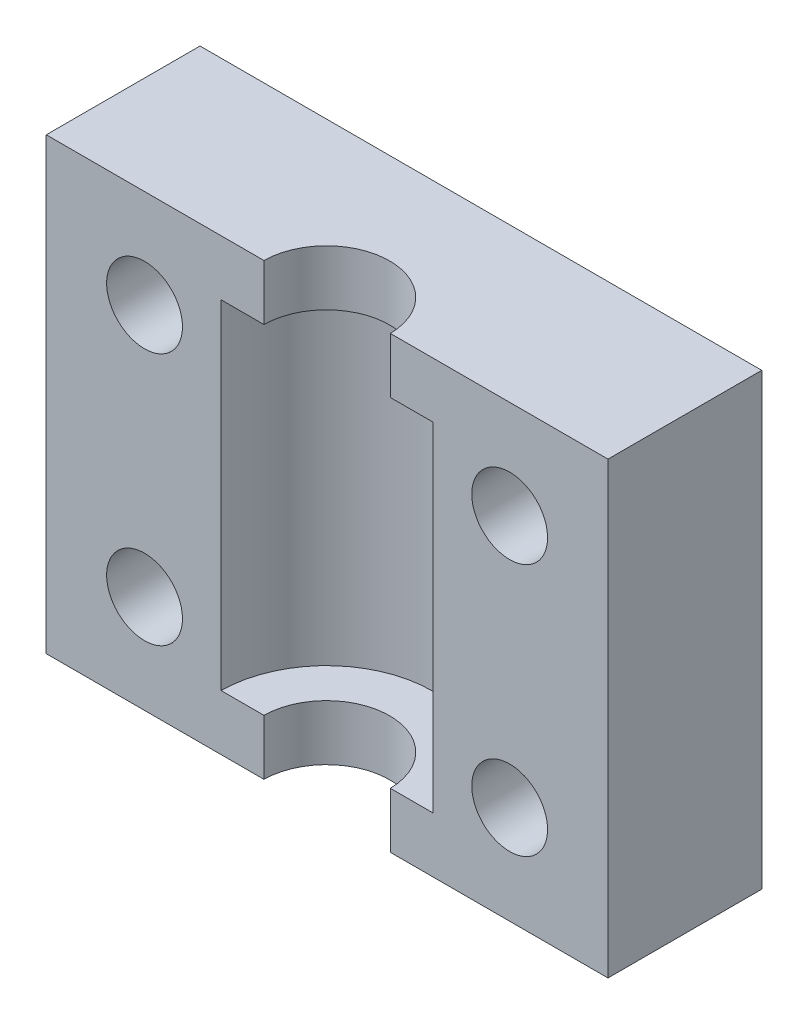
ISO-10303-21;
HEADER;
FILE_DESCRIPTION(('STEP AP214'),'2;1');
FILE_NAME('part.step','',(''),(''),'','','');
FILE_SCHEMA(('AUTOMOTIVE_DESIGN { 1 0 10303 214 1 1 1 1 }'));
ENDSEC;
DATA;
#1=APPLICATION_CONTEXT('core data for automotive mechanical design processes');
#2=APPLICATION_PROTOCOL_DEFINITION('international standard','automotive_design',2000,#1);
#3=PRODUCT_CONTEXT('',#1,'mechanical');
#4=PRODUCT('Part','Part','',(#3));
#5=PRODUCT_RELATED_PRODUCT_CATEGORY('part','',(#4));
#6=PRODUCT_DEFINITION_FORMATION('','',#4);
#7=PRODUCT_DEFINITION_CONTEXT('part definition',#1,'design');
#8=PRODUCT_DEFINITION('design','',#6,#7);
#9=PRODUCT_DEFINITION_SHAPE('','',#8);
#10=(LENGTH_UNIT() NAMED_UNIT(*) SI_UNIT(.MILLI.,.METRE.));
#11=(NAMED_UNIT(*) PLANE_ANGLE_UNIT() SI_UNIT($,.RADIAN.));
#12=(NAMED_UNIT(*) SI_UNIT($,.STERADIAN.) SOLID_ANGLE_UNIT());
#13=UNCERTAINTY_MEASURE_WITH_UNIT(LENGTH_MEASURE(1.E-05),#10,'distance_accuracy_value','');
#14=(GEOMETRIC_REPRESENTATION_CONTEXT(3) GLOBAL_UNCERTAINTY_ASSIGNED_CONTEXT((#13)) GLOBAL_UNIT_ASSIGNED_CONTEXT((#10,
#11,#12)) REPRESENTATION_CONTEXT('',''));
#15=CARTESIAN_POINT('',(0.,0.,0.));
#16=DIRECTION('',(0.,0.,1.));
#17=DIRECTION('',(1.,0.,0.));
#18=AXIS2_PLACEMENT_3D('',#15,#16,#17);
#19=CARTESIAN_POINT('',(-339.725,6547.28699999999,2827.35040000001));
#20=DIRECTION('',(0.,-1.,0.));
#21=DIRECTION('',(0.,0.,-1.));
#22=AXIS2_PLACEMENT_3D('',#19,#20,#21);
#23=CYLINDRICAL_SURFACE('',#22,4.49999999999981);
#24=CARTESIAN_POINT('',(-339.725,6545.31200000001,2827.35040000001));
#25=DIRECTION('',(0.,-1.,0.));
#26=DIRECTION('',(0.,0.,-1.));
#27=AXIS2_PLACEMENT_3D('',#24,#25,#26);
#28=CIRCLE('',#27,4.49999999999981);
#29=CARTESIAN_POINT('',(-344.224722213649,6545.31200000001,2827.30040000001));
#30=VERTEX_POINT('',#29);
#31=CARTESIAN_POINT('',(-335.225277786351,6545.31200000001,2827.30040000001));
#32=VERTEX_POINT('',#31);
#33=EDGE_CURVE('E103',#30,#32,#28,.T.);
#34=ORIENTED_EDGE('',*,*,#33,.T.);
#35=DIRECTION('',(0.,1.,0.));
#36=VECTOR('',#35,1.);
#37=CARTESIAN_POINT('',(-335.225277786351,6533.26200000001,2827.30040000001));
#38=LINE('',#37,#36);
#39=CARTESIAN_POINT('',(-335.225277786351,6549.26199999999,2827.30040000001));
#40=VERTEX_POINT('',#39);
#41=EDGE_CURVE('E245',#32,#40,#38,.T.);
#42=ORIENTED_EDGE('',*,*,#41,.T.);
#43=CARTESIAN_POINT('',(-339.725,6549.26199999999,2827.35040000001));
#44=DIRECTION('',(0.,-1.,0.));
#45=DIRECTION('',(0.,0.,-1.));
#46=AXIS2_PLACEMENT_3D('',#43,#44,#45);
#47=CIRCLE('',#46,4.49999999999981);
#48=CARTESIAN_POINT('',(-344.224722213649,6549.26199999999,2827.30040000001));
#49=VERTEX_POINT('',#48);
#50=EDGE_CURVE('E153',#49,#40,#47,.T.);
#51=ORIENTED_EDGE('',*,*,#50,.F.);
#52=DIRECTION('',(0.,1.,0.));
#53=VECTOR('',#52,1.);
#54=CARTESIAN_POINT('',(-344.224722213649,6533.26200000001,2827.30040000001));
#55=LINE('',#54,#53);
#56=EDGE_CURVE('E147',#49,#30,#55,.F.);
#57=ORIENTED_EDGE('',*,*,#56,.T.);
#58=EDGE_LOOP('',(#34,#42,#51,#57));
#59=FACE_BOUND('',#58,.T.);
#60=ADVANCED_FACE('F100',(#59),#23,.F.);
#61=CARTESIAN_POINT('',(-332.175,6545.31200000001,2827.35040000001));
#62=DIRECTION('',(0.,1.,0.));
#63=DIRECTION('',(0.,0.,1.));
#64=AXIS2_PLACEMENT_3D('',#61,#62,#63);
#65=PLANE('',#64);
#66=CARTESIAN_POINT('',(-339.725,6545.31200000001,2827.35040000001));
#67=DIRECTION('',(0.,-1.,0.));
#68=DIRECTION('',(0.,0.,-1.));
#69=AXIS2_PLACEMENT_3D('',#66,#67,#68);
#70=CIRCLE('',#69,7.54999999999982);
#71=CARTESIAN_POINT('',(-347.274834435271,6545.31200000001,2827.30040000001));
#72=VERTEX_POINT('',#71);
#73=CARTESIAN_POINT('',(-332.175165564729,6545.31200000001,2827.30040000001));
#74=VERTEX_POINT('',#73);
#75=EDGE_CURVE('E291',#72,#74,#70,.T.);
#76=ORIENTED_EDGE('',*,*,#75,.T.);
#77=DIRECTION('',(-1.,0.,0.));
#78=VECTOR('',#77,1.);
#79=CARTESIAN_POINT('',(-339.725,6545.31200000001,2827.30040000001));
#80=LINE('',#79,#78);
#81=EDGE_CURVE('E249',#74,#32,#80,.T.);
#82=ORIENTED_EDGE('',*,*,#81,.T.);
#83=ORIENTED_EDGE('',*,*,#33,.F.);
#84=DIRECTION('',(-1.,0.,0.));
#85=VECTOR('',#84,1.);
#86=CARTESIAN_POINT('',(-339.725,6545.31200000001,2827.30040000001));
#87=LINE('',#86,#85);
#88=EDGE_CURVE('E233',#30,#72,#87,.T.);
#89=ORIENTED_EDGE('',*,*,#88,.T.);
#90=EDGE_LOOP('',(#76,#82,#83,#89));
#91=FACE_BOUND('',#90,.T.);
#92=ADVANCED_FACE('F297',(#91),#65,.F.);
#93=CARTESIAN_POINT('',(-339.725,6533.26200000001,2827.35040000001));
#94=DIRECTION('',(0.,-1.,0.));
#95=DIRECTION('',(0.,0.,-1.));
#96=AXIS2_PLACEMENT_3D('',#93,#94,#95);
#97=CYLINDRICAL_SURFACE('',#96,7.54999999999982);
#98=CARTESIAN_POINT('',(-339.725,6521.212,2827.35040000001));
#99=DIRECTION('',(0.,-1.,0.));
#100=DIRECTION('',(0.,0.,-1.));
#101=AXIS2_PLACEMENT_3D('',#98,#99,#100);
#102=CIRCLE('',#101,7.54999999999982);
#103=CARTESIAN_POINT('',(-347.274834435271,6521.212,2827.30040000001));
#104=VERTEX_POINT('',#103);
#105=CARTESIAN_POINT('',(-332.175165564729,6521.212,2827.30040000001));
#106=VERTEX_POINT('',#105);
#107=EDGE_CURVE('E290',#104,#106,#102,.T.);
#108=ORIENTED_EDGE('',*,*,#107,.T.);
#109=DIRECTION('',(0.,1.,0.));
#110=VECTOR('',#109,1.);
#111=CARTESIAN_POINT('',(-332.175165564728,6533.26200000001,2827.30040000001));
#112=LINE('',#111,#110);
#113=EDGE_CURVE('E252',#106,#74,#112,.T.);
#114=ORIENTED_EDGE('',*,*,#113,.T.);
#115=ORIENTED_EDGE('',*,*,#75,.F.);
#116=DIRECTION('',(0.,1.,0.));
#117=VECTOR('',#116,1.);
#118=CARTESIAN_POINT('',(-347.274834435272,6533.26200000001,2827.30040000001));
#119=LINE('',#118,#117);
#120=EDGE_CURVE('E231',#72,#104,#119,.F.);
#121=ORIENTED_EDGE('',*,*,#120,.T.);
#122=EDGE_LOOP('',(#108,#114,#115,#121));
#123=FACE_BOUND('',#122,.T.);
#124=ADVANCED_FACE('F315',(#123),#97,.F.);
#125=CARTESIAN_POINT('',(-335.225,6521.212,2827.35040000001));
#126=DIRECTION('',(0.,-1.,0.));
#127=DIRECTION('',(0.,0.,-1.));
#128=AXIS2_PLACEMENT_3D('',#125,#126,#127);
#129=PLANE('',#128);
#130=CARTESIAN_POINT('',(-339.725,6521.212,2827.35040000001));
#131=DIRECTION('',(0.,-1.,0.));
#132=DIRECTION('',(0.,0.,-1.));
#133=AXIS2_PLACEMENT_3D('',#130,#131,#132);
#134=CIRCLE('',#133,4.49999999999981);
#135=CARTESIAN_POINT('',(-344.224722213649,6521.212,2827.30040000001));
#136=VERTEX_POINT('',#135);
#137=CARTESIAN_POINT('',(-335.225277786351,6521.212,2827.30040000001));
#138=VERTEX_POINT('',#137);
#139=EDGE_CURVE('E288',#136,#138,#134,.T.);
#140=ORIENTED_EDGE('',*,*,#139,.T.);
#141=DIRECTION('',(-1.,0.,0.));
#142=VECTOR('',#141,1.);
#143=CARTESIAN_POINT('',(-339.725,6521.212,2827.30040000001));
#144=LINE('',#143,#142);
#145=EDGE_CURVE('E255',#138,#106,#144,.F.);
#146=ORIENTED_EDGE('',*,*,#145,.T.);
#147=ORIENTED_EDGE('',*,*,#107,.F.);
#148=DIRECTION('',(-1.,0.,0.));
#149=VECTOR('',#148,1.);
#150=CARTESIAN_POINT('',(-339.725,6521.212,2827.30040000001));
#151=LINE('',#150,#149);
#152=EDGE_CURVE('E229',#104,#136,#151,.F.);
#153=ORIENTED_EDGE('',*,*,#152,.T.);
#154=EDGE_LOOP('',(#140,#146,#147,#153));
#155=FACE_BOUND('',#154,.T.);
#156=ADVANCED_FACE('F319',(#155),#129,.F.);
#157=CARTESIAN_POINT('',(-339.725,6519.237,2827.35040000001));
#158=DIRECTION('',(0.,-1.,0.));
#159=DIRECTION('',(0.,0.,-1.));
#160=AXIS2_PLACEMENT_3D('',#157,#158,#159);
#161=CYLINDRICAL_SURFACE('',#160,4.49999999999981);
#162=CARTESIAN_POINT('',(-339.725,6517.26199999999,2827.35040000001));
#163=DIRECTION('',(0.,-1.,0.));
#164=DIRECTION('',(0.,0.,-1.));
#165=AXIS2_PLACEMENT_3D('',#162,#163,#164);
#166=CIRCLE('',#165,4.49999999999981);
#167=CARTESIAN_POINT('',(-335.225277786351,6517.26199999999,2827.30040000001));
#168=VERTEX_POINT('',#167);
#169=CARTESIAN_POINT('',(-344.224722213649,6517.26199999999,2827.30040000001));
#170=VERTEX_POINT('',#169);
#171=EDGE_CURVE('E286',#168,#170,#166,.F.);
#172=ORIENTED_EDGE('',*,*,#171,.F.);
#173=DIRECTION('',(0.,1.,0.));
#174=VECTOR('',#173,1.);
#175=CARTESIAN_POINT('',(-335.225277786351,6533.26200000001,2827.30040000001));
#176=LINE('',#175,#174);
#177=EDGE_CURVE('E258',#168,#138,#176,.T.);
#178=ORIENTED_EDGE('',*,*,#177,.T.);
#179=ORIENTED_EDGE('',*,*,#139,.F.);
#180=DIRECTION('',(0.,1.,0.));
#181=VECTOR('',#180,1.);
#182=CARTESIAN_POINT('',(-344.224722213649,6533.26200000001,2827.30040000001));
#183=LINE('',#182,#181);
#184=EDGE_CURVE('E118',#136,#170,#183,.F.);
#185=ORIENTED_EDGE('',*,*,#184,.T.);
#186=EDGE_LOOP('',(#172,#178,#179,#185));
#187=FACE_BOUND('',#186,.T.);
#188=ADVANCED_FACE('F320',(#187),#161,.F.);
#189=CARTESIAN_POINT('',(-319.725000000001,6517.26199999999,2827.35040000001));
#190=DIRECTION('',(0.,-1.,0.));
#191=DIRECTION('',(0.,0.,-1.));
#192=AXIS2_PLACEMENT_3D('',#189,#190,#191);
#193=PLANE('',#192);
#194=DIRECTION('',(-1.,0.,0.));
#195=VECTOR('',#194,1.);
#196=CARTESIAN_POINT('',(-339.725,6517.26199999999,2827.30040000001));
#197=LINE('',#196,#195);
#198=CARTESIAN_POINT('',(-359.724999999999,6517.262,2827.30040000001));
#199=VERTEX_POINT('',#198);
#200=EDGE_CURVE('E221',#170,#199,#197,.T.);
#201=ORIENTED_EDGE('',*,*,#200,.T.);
#202=DIRECTION('',(0.,0.,-1.));
#203=VECTOR('',#202,1.);
#204=CARTESIAN_POINT('',(-359.724999999999,6517.262,2834.37146781187));
#205=LINE('',#204,#203);
#206=CARTESIAN_POINT('',(-359.724999999999,6517.262,2816.3504));
#207=VERTEX_POINT('',#206);
#208=EDGE_CURVE('E212',#199,#207,#205,.T.);
#209=ORIENTED_EDGE('',*,*,#208,.T.);
#210=DIRECTION('',(-1.,-1.48029736616735E-13,0.));
#211=VECTOR('',#210,1.);
#212=CARTESIAN_POINT('',(-324.725000000007,6517.262,2816.3504));
#213=LINE('',#212,#211);
#214=CARTESIAN_POINT('',(-319.725000000004,6517.262,2816.3504));
#215=VERTEX_POINT('',#214);
#216=EDGE_CURVE('E193',#215,#207,#213,.T.);
#217=ORIENTED_EDGE('',*,*,#216,.F.);
#218=DIRECTION('',(0.,0.,-1.));
#219=VECTOR('',#218,1.);
#220=CARTESIAN_POINT('',(-319.725000000004,6517.262,2834.37146781187));
#221=LINE('',#220,#219);
#222=CARTESIAN_POINT('',(-319.725000000004,6517.262,2827.30040000001));
#223=VERTEX_POINT('',#222);
#224=EDGE_CURVE('E190',#223,#215,#221,.T.);
#225=ORIENTED_EDGE('',*,*,#224,.F.);
#226=DIRECTION('',(-1.,0.,0.));
#227=VECTOR('',#226,1.);
#228=CARTESIAN_POINT('',(-339.725,6517.26199999999,2827.30040000001));
#229=LINE('',#228,#227);
#230=EDGE_CURVE('E261',#223,#168,#229,.T.);
#231=ORIENTED_EDGE('',*,*,#230,.T.);
#232=ORIENTED_EDGE('',*,*,#171,.T.);
#233=EDGE_LOOP('',(#201,#209,#217,#225,#231,#232));
#234=FACE_BOUND('',#233,.T.);
#235=ADVANCED_FACE('F304',(#234),#193,.T.);
#236=CARTESIAN_POINT('',(-359.724999999999,6517.26199999999,2827.35040000001));
#237=DIRECTION('',(-1.,0.,0.));
#238=DIRECTION('',(0.,0.,1.));
#239=AXIS2_PLACEMENT_3D('',#236,#237,#238);
#240=PLANE('',#239);
#241=DIRECTION('',(0.,1.,0.));
#242=VECTOR('',#241,1.);
#243=CARTESIAN_POINT('',(-359.724999999999,6533.26200000001,2827.30040000001));
#244=LINE('',#243,#242);
#245=CARTESIAN_POINT('',(-359.724999999997,6549.26199999999,2827.30040000001));
#246=VERTEX_POINT('',#245);
#247=EDGE_CURVE('E217',#199,#246,#244,.T.);
#248=ORIENTED_EDGE('',*,*,#247,.T.);
#249=DIRECTION('',(0.,0.,-1.));
#250=VECTOR('',#249,1.);
#251=CARTESIAN_POINT('',(-359.724999999997,6549.26199999999,2834.37146781187));
#252=LINE('',#251,#250);
#253=CARTESIAN_POINT('',(-359.724999999997,6549.26199999999,2816.3504));
#254=VERTEX_POINT('',#253);
#255=EDGE_CURVE('E208',#246,#254,#252,.T.);
#256=ORIENTED_EDGE('',*,*,#255,.T.);
#257=DIRECTION('',(1.00929365874964E-13,1.,0.));
#258=VECTOR('',#257,1.);
#259=CARTESIAN_POINT('',(-359.724999999999,6522.262,2816.3504));
#260=LINE('',#259,#258);
#261=EDGE_CURVE('E198',#207,#254,#260,.T.);
#262=ORIENTED_EDGE('',*,*,#261,.F.);
#263=ORIENTED_EDGE('',*,*,#208,.F.);
#264=EDGE_LOOP('',(#248,#256,#262,#263));
#265=FACE_BOUND('',#264,.T.);
#266=ADVANCED_FACE('F308',(#265),#240,.T.);
#267=CARTESIAN_POINT('',(-359.724999999999,6549.26199999999,2827.35040000001));
#268=DIRECTION('',(0.,1.,0.));
#269=DIRECTION('',(0.,0.,1.));
#270=AXIS2_PLACEMENT_3D('',#267,#268,#269);
#271=PLANE('',#270);
#272=DIRECTION('',(-1.,0.,0.));
#273=VECTOR('',#272,1.);
#274=CARTESIAN_POINT('',(-339.725,6549.26199999999,2827.30040000001));
#275=LINE('',#274,#273);
#276=CARTESIAN_POINT('',(-319.725000000001,6549.262,2827.30040000001));
#277=VERTEX_POINT('',#276);
#278=EDGE_CURVE('E206',#40,#277,#275,.F.);
#279=ORIENTED_EDGE('',*,*,#278,.T.);
#280=DIRECTION('',(0.,0.,-1.));
#281=VECTOR('',#280,1.);
#282=CARTESIAN_POINT('',(-319.725000000001,6549.262,2834.37146781187));
#283=LINE('',#282,#281);
#284=CARTESIAN_POINT('',(-319.725000000001,6549.262,2816.3504));
#285=VERTEX_POINT('',#284);
#286=EDGE_CURVE('E188',#277,#285,#283,.T.);
#287=ORIENTED_EDGE('',*,*,#286,.T.);
#288=DIRECTION('',(1.,1.48029736616643E-13,0.));
#289=VECTOR('',#288,1.);
#290=CARTESIAN_POINT('',(-354.725000000003,6549.26199999999,2816.3504));
#291=LINE('',#290,#289);
#292=EDGE_CURVE('E194',#254,#285,#291,.T.);
#293=ORIENTED_EDGE('',*,*,#292,.F.);
#294=ORIENTED_EDGE('',*,*,#255,.F.);
#295=DIRECTION('',(-1.,0.,0.));
#296=VECTOR('',#295,1.);
#297=CARTESIAN_POINT('',(-339.725,6549.26199999999,2827.30040000001));
#298=LINE('',#297,#296);
#299=EDGE_CURVE('E236',#246,#49,#298,.F.);
#300=ORIENTED_EDGE('',*,*,#299,.T.);
#301=ORIENTED_EDGE('',*,*,#50,.T.);
#302=EDGE_LOOP('',(#279,#287,#293,#294,#300,#301));
#303=FACE_BOUND('',#302,.T.);
#304=ADVANCED_FACE('F204',(#303),#271,.T.);
#305=CARTESIAN_POINT('',(-319.725000000001,6549.26199999999,2827.35040000001));
#306=DIRECTION('',(1.,0.,0.));
#307=DIRECTION('',(0.,0.,-1.));
#308=AXIS2_PLACEMENT_3D('',#305,#306,#307);
#309=PLANE('',#308);
#310=DIRECTION('',(0.,1.,0.));
#311=VECTOR('',#310,1.);
#312=CARTESIAN_POINT('',(-319.725000000001,6533.26200000001,2827.30040000001));
#313=LINE('',#312,#311);
#314=EDGE_CURVE('E238',#277,#223,#313,.F.);
#315=ORIENTED_EDGE('',*,*,#314,.T.);
#316=ORIENTED_EDGE('',*,*,#224,.T.);
#317=DIRECTION('',(-1.16068770756209E-13,-1.,0.));
#318=VECTOR('',#317,1.);
#319=CARTESIAN_POINT('',(-319.725000000001,6544.26200000001,2816.3504));
#320=LINE('',#319,#318);
#321=EDGE_CURVE('E183',#285,#215,#320,.T.);
#322=ORIENTED_EDGE('',*,*,#321,.F.);
#323=ORIENTED_EDGE('',*,*,#286,.F.);
#324=EDGE_LOOP('',(#315,#316,#322,#323));
#325=FACE_BOUND('',#324,.T.);
#326=ADVANCED_FACE('F186',(#325),#309,.T.);
#327=CARTESIAN_POINT('',(-339.725,6533.26200000001,2827.30040000001));
#328=DIRECTION('',(0.,0.,-1.));
#329=DIRECTION('',(-1.,0.,0.));
#330=AXIS2_PLACEMENT_3D('',#327,#328,#329);
#331=PLANE('',#330);
#332=ORIENTED_EDGE('',*,*,#314,.F.);
#333=ORIENTED_EDGE('',*,*,#278,.F.);
#334=ORIENTED_EDGE('',*,*,#41,.F.);
#335=ORIENTED_EDGE('',*,*,#81,.F.);
#336=ORIENTED_EDGE('',*,*,#113,.F.);
#337=ORIENTED_EDGE('',*,*,#145,.F.);
#338=ORIENTED_EDGE('',*,*,#177,.F.);
#339=ORIENTED_EDGE('',*,*,#230,.F.);
#340=EDGE_LOOP('',(#332,#333,#334,#335,#336,#337,#338,#339));
#341=FACE_BOUND('',#340,.T.);
#342=CARTESIAN_POINT('',(-326.725000000001,6542.262,2827.30040000001));
#343=DIRECTION('',(0.,0.,-1.));
#344=DIRECTION('',(-1.,0.,0.));
#345=AXIS2_PLACEMENT_3D('',#342,#343,#344);
#346=CIRCLE('',#345,2.70000000000002);
#347=CARTESIAN_POINT('',(-329.425000000001,6542.262,2827.30040000001));
#348=VERTEX_POINT('',#347);
#349=EDGE_CURVE('E280',#348,#348,#346,.T.);
#350=ORIENTED_EDGE('',*,*,#349,.T.);
#351=EDGE_LOOP('',(#350));
#352=FACE_BOUND('',#351,.T.);
#353=CARTESIAN_POINT('',(-326.725000000001,6524.26200000002,2827.30040000001));
#354=DIRECTION('',(0.,0.,-1.));
#355=DIRECTION('',(-1.,0.,0.));
#356=AXIS2_PLACEMENT_3D('',#353,#354,#355);
#357=CIRCLE('',#356,2.70000000000002);
#358=CARTESIAN_POINT('',(-329.425000000001,6524.26200000002,2827.30040000001));
#359=VERTEX_POINT('',#358);
#360=EDGE_CURVE('E277',#359,#359,#357,.T.);
#361=ORIENTED_EDGE('',*,*,#360,.T.);
#362=EDGE_LOOP('',(#361));
#363=FACE_BOUND('',#362,.T.);
#364=ADVANCED_FACE('F300',(#341,#352,#363),#331,.F.);
#365=CARTESIAN_POINT('',(-339.725,6533.26200000001,2827.30040000001));
#366=DIRECTION('',(0.,0.,-1.));
#367=DIRECTION('',(-1.,0.,0.));
#368=AXIS2_PLACEMENT_3D('',#365,#366,#367);
#369=PLANE('',#368);
#370=ORIENTED_EDGE('',*,*,#247,.F.);
#371=ORIENTED_EDGE('',*,*,#200,.F.);
#372=ORIENTED_EDGE('',*,*,#184,.F.);
#373=ORIENTED_EDGE('',*,*,#152,.F.);
#374=ORIENTED_EDGE('',*,*,#120,.F.);
#375=ORIENTED_EDGE('',*,*,#88,.F.);
#376=ORIENTED_EDGE('',*,*,#56,.F.);
#377=ORIENTED_EDGE('',*,*,#299,.F.);
#378=EDGE_LOOP('',(#370,#371,#372,#373,#374,#375,#376,#377));
#379=FACE_BOUND('',#378,.T.);
#380=CARTESIAN_POINT('',(-352.724999999999,6524.26200000002,2827.30040000001));
#381=DIRECTION('',(0.,0.,1.));
#382=DIRECTION('',(1.,0.,0.));
#383=AXIS2_PLACEMENT_3D('',#380,#381,#382);
#384=CIRCLE('',#383,2.70000000000002);
#385=CARTESIAN_POINT('',(-350.024999999999,6524.26200000002,2827.30040000001));
#386=VERTEX_POINT('',#385);
#387=EDGE_CURVE('E220',#386,#386,#384,.F.);
#388=ORIENTED_EDGE('',*,*,#387,.T.);
#389=EDGE_LOOP('',(#388));
#390=FACE_BOUND('',#389,.T.);
#391=CARTESIAN_POINT('',(-352.724999999999,6542.262,2827.30040000001));
#392=DIRECTION('',(0.,0.,1.));
#393=DIRECTION('',(1.,0.,0.));
#394=AXIS2_PLACEMENT_3D('',#391,#392,#393);
#395=CIRCLE('',#394,2.70000000000002);
#396=CARTESIAN_POINT('',(-350.024999999999,6542.262,2827.30040000001));
#397=VERTEX_POINT('',#396);
#398=EDGE_CURVE('E274',#397,#397,#395,.F.);
#399=ORIENTED_EDGE('',*,*,#398,.T.);
#400=EDGE_LOOP('',(#399));
#401=FACE_BOUND('',#400,.T.);
#402=ADVANCED_FACE('F310',(#379,#390,#401),#369,.F.);
#403=CARTESIAN_POINT('',(-352.724999999999,6524.26200000002,2827.35040000001));
#404=DIRECTION('',(0.,0.,1.));
#405=DIRECTION('',(1.,0.,0.));
#406=AXIS2_PLACEMENT_3D('',#403,#404,#405);
#407=CYLINDRICAL_SURFACE('',#406,2.70000000000002);
#408=ORIENTED_EDGE('',*,*,#387,.F.);
#409=EDGE_LOOP('',(#408));
#410=FACE_BOUND('',#409,.T.);
#411=CARTESIAN_POINT('',(-352.724999999999,6524.26200000002,2816.3504));
#412=DIRECTION('',(0.,0.,1.));
#413=DIRECTION('',(1.,0.,0.));
#414=AXIS2_PLACEMENT_3D('',#411,#412,#413);
#415=CIRCLE('',#414,2.70000000000002);
#416=CARTESIAN_POINT('',(-350.024999999999,6524.26200000002,2816.3504));
#417=VERTEX_POINT('',#416);
#418=EDGE_CURVE('E271',#417,#417,#415,.T.);
#419=ORIENTED_EDGE('',*,*,#418,.F.);
#420=EDGE_LOOP('',(#419));
#421=FACE_BOUND('',#420,.T.);
#422=ADVANCED_FACE('F347',(#410,#421),#407,.F.);
#423=CARTESIAN_POINT('',(-326.725000000001,6542.262,2827.35040000001));
#424=DIRECTION('',(0.,0.,-1.));
#425=DIRECTION('',(-1.,0.,0.));
#426=AXIS2_PLACEMENT_3D('',#423,#424,#425);
#427=CYLINDRICAL_SURFACE('',#426,2.70000000000002);
#428=ORIENTED_EDGE('',*,*,#349,.F.);
#429=EDGE_LOOP('',(#428));
#430=FACE_BOUND('',#429,.T.);
#431=CARTESIAN_POINT('',(-326.725000000001,6542.262,2816.3504));
#432=DIRECTION('',(0.,0.,-1.));
#433=DIRECTION('',(-1.,0.,0.));
#434=AXIS2_PLACEMENT_3D('',#431,#432,#433);
#435=CIRCLE('',#434,2.70000000000002);
#436=CARTESIAN_POINT('',(-329.425000000001,6542.262,2816.3504));
#437=VERTEX_POINT('',#436);
#438=EDGE_CURVE('E268',#437,#437,#435,.F.);
#439=ORIENTED_EDGE('',*,*,#438,.F.);
#440=EDGE_LOOP('',(#439));
#441=FACE_BOUND('',#440,.T.);
#442=ADVANCED_FACE('F343',(#430,#441),#427,.F.);
#443=CARTESIAN_POINT('',(-326.725000000001,6524.26200000002,2827.35040000001));
#444=DIRECTION('',(0.,0.,-1.));
#445=DIRECTION('',(-1.,0.,0.));
#446=AXIS2_PLACEMENT_3D('',#443,#444,#445);
#447=CYLINDRICAL_SURFACE('',#446,2.70000000000002);
#448=ORIENTED_EDGE('',*,*,#360,.F.);
#449=EDGE_LOOP('',(#448));
#450=FACE_BOUND('',#449,.T.);
#451=CARTESIAN_POINT('',(-326.725000000001,6524.26200000002,2816.3504));
#452=DIRECTION('',(0.,0.,-1.));
#453=DIRECTION('',(-1.,0.,0.));
#454=AXIS2_PLACEMENT_3D('',#451,#452,#453);
#455=CIRCLE('',#454,2.70000000000002);
#456=CARTESIAN_POINT('',(-329.425000000001,6524.26200000002,2816.3504));
#457=VERTEX_POINT('',#456);
#458=EDGE_CURVE('E109',#457,#457,#455,.F.);
#459=ORIENTED_EDGE('',*,*,#458,.F.);
#460=EDGE_LOOP('',(#459));
#461=FACE_BOUND('',#460,.T.);
#462=ADVANCED_FACE('F336',(#450,#461),#447,.F.);
#463=CARTESIAN_POINT('',(-352.724999999999,6542.262,2827.35040000001));
#464=DIRECTION('',(0.,0.,1.));
#465=DIRECTION('',(1.,0.,0.));
#466=AXIS2_PLACEMENT_3D('',#463,#464,#465);
#467=CYLINDRICAL_SURFACE('',#466,2.70000000000002);
#468=ORIENTED_EDGE('',*,*,#398,.F.);
#469=EDGE_LOOP('',(#468));
#470=FACE_BOUND('',#469,.T.);
#471=CARTESIAN_POINT('',(-352.724999999999,6542.262,2816.3504));
#472=DIRECTION('',(0.,0.,1.));
#473=DIRECTION('',(1.,0.,0.));
#474=AXIS2_PLACEMENT_3D('',#471,#472,#473);
#475=CIRCLE('',#474,2.70000000000002);
#476=CARTESIAN_POINT('',(-350.024999999999,6542.262,2816.3504));
#477=VERTEX_POINT('',#476);
#478=EDGE_CURVE('E14',#477,#477,#475,.T.);
#479=ORIENTED_EDGE('',*,*,#478,.F.);
#480=EDGE_LOOP('',(#479));
#481=FACE_BOUND('',#480,.T.);
#482=ADVANCED_FACE('F330',(#470,#481),#467,.F.);
#483=CARTESIAN_POINT('',(-339.725,6533.26200000001,2816.3504));
#484=DIRECTION('',(0.,0.,-1.));
#485=DIRECTION('',(-1.,0.,0.));
#486=AXIS2_PLACEMENT_3D('',#483,#484,#485);
#487=PLANE('',#486);
#488=ORIENTED_EDGE('',*,*,#478,.T.);
#489=EDGE_LOOP('',(#488));
#490=FACE_BOUND('',#489,.T.);
#491=ORIENTED_EDGE('',*,*,#458,.T.);
#492=EDGE_LOOP('',(#491));
#493=FACE_BOUND('',#492,.T.);
#494=ORIENTED_EDGE('',*,*,#438,.T.);
#495=EDGE_LOOP('',(#494));
#496=FACE_BOUND('',#495,.T.);
#497=ORIENTED_EDGE('',*,*,#418,.T.);
#498=EDGE_LOOP('',(#497));
#499=FACE_BOUND('',#498,.T.);
#500=ORIENTED_EDGE('',*,*,#261,.T.);
#501=ORIENTED_EDGE('',*,*,#292,.T.);
#502=ORIENTED_EDGE('',*,*,#321,.T.);
#503=ORIENTED_EDGE('',*,*,#216,.T.);
#504=EDGE_LOOP('',(#500,#501,#502,#503));
#505=FACE_BOUND('',#504,.T.);
#506=ADVANCED_FACE('F197',(#490,#493,#496,#499,#505),#487,.T.);
#507=CLOSED_SHELL('',(#60,#92,#124,#156,#188,#235,#266,#304,#326,#364,#402,#422,#442,#462,#482,#506));
#508=MANIFOLD_SOLID_BREP('B2',#507);
#509=ADVANCED_BREP_SHAPE_REPRESENTATION('',(#18,#508),#14);
#510=SHAPE_DEFINITION_REPRESENTATION(#9,#509);
ENDSEC;
END-ISO-10303-21;
